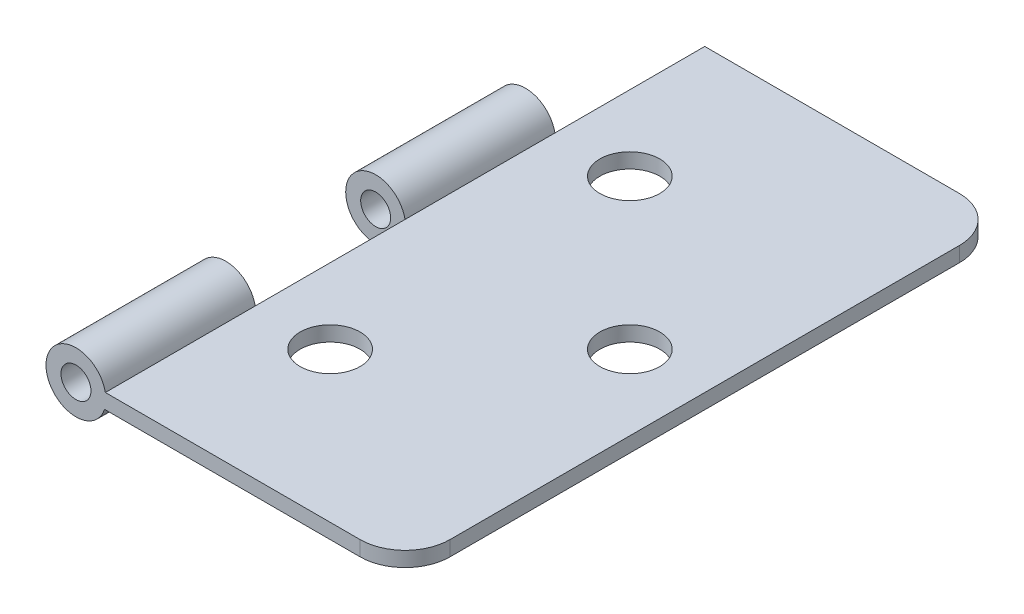
ISO-10303-21;
HEADER;
FILE_DESCRIPTION(('STEP AP214'),'2;1');
FILE_NAME('part.step','',(''),(''),'','','');
FILE_SCHEMA(('AUTOMOTIVE_DESIGN { 1 0 10303 214 1 1 1 1 }'));
ENDSEC;
DATA;
#1=APPLICATION_CONTEXT('core data for automotive mechanical design processes');
#2=APPLICATION_PROTOCOL_DEFINITION('international standard','automotive_design',2000,#1);
#3=PRODUCT_CONTEXT('',#1,'mechanical');
#4=PRODUCT('Part','Part','',(#3));
#5=PRODUCT_RELATED_PRODUCT_CATEGORY('part','',(#4));
#6=PRODUCT_DEFINITION_FORMATION('','',#4);
#7=PRODUCT_DEFINITION_CONTEXT('part definition',#1,'design');
#8=PRODUCT_DEFINITION('design','',#6,#7);
#9=PRODUCT_DEFINITION_SHAPE('','',#8);
#10=(LENGTH_UNIT() NAMED_UNIT(*) SI_UNIT(.MILLI.,.METRE.));
#11=(NAMED_UNIT(*) PLANE_ANGLE_UNIT() SI_UNIT($,.RADIAN.));
#12=(NAMED_UNIT(*) SI_UNIT($,.STERADIAN.) SOLID_ANGLE_UNIT());
#13=UNCERTAINTY_MEASURE_WITH_UNIT(LENGTH_MEASURE(1.E-05),#10,'distance_accuracy_value','');
#14=(GEOMETRIC_REPRESENTATION_CONTEXT(3) GLOBAL_UNCERTAINTY_ASSIGNED_CONTEXT((#13)) GLOBAL_UNIT_ASSIGNED_CONTEXT((#10,
#11,#12)) REPRESENTATION_CONTEXT('',''));
#15=CARTESIAN_POINT('',(0.,0.,0.));
#16=DIRECTION('',(0.,0.,1.));
#17=DIRECTION('',(1.,0.,0.));
#18=AXIS2_PLACEMENT_3D('',#15,#16,#17);
#19=CARTESIAN_POINT('',(-7.85329821480531,0.608036601797693,-40.));
#20=DIRECTION('',(0.,0.,1.));
#21=DIRECTION('',(1.,0.,0.));
#22=AXIS2_PLACEMENT_3D('',#19,#20,#21);
#23=CYLINDRICAL_SURFACE('',#22,2.);
#24=CARTESIAN_POINT('',(-7.85329821480531,0.608036601797693,-30.));
#25=DIRECTION('',(0.,0.,1.));
#26=DIRECTION('',(1.,0.,0.));
#27=AXIS2_PLACEMENT_3D('',#24,#25,#26);
#28=CIRCLE('',#27,2.);
#29=CARTESIAN_POINT('',(-5.94796583149936,0.,-30.));
#30=VERTEX_POINT('',#29);
#31=CARTESIAN_POINT('',(-5.89208310817633,1.,-30.));
#32=VERTEX_POINT('',#31);
#33=EDGE_CURVE('E149',#30,#32,#28,.T.);
#34=ORIENTED_EDGE('',*,*,#33,.T.);
#35=DIRECTION('',(0.,0.,1.));
#36=VECTOR('',#35,1.);
#37=CARTESIAN_POINT('',(-5.89208310817633,1.,-40.));
#38=LINE('',#37,#36);
#39=CARTESIAN_POINT('',(-5.89208310817633,1.,-40.));
#40=VERTEX_POINT('',#39);
#41=EDGE_CURVE('E196',#40,#32,#38,.T.);
#42=ORIENTED_EDGE('',*,*,#41,.F.);
#43=CARTESIAN_POINT('',(-7.85329821480531,0.608036601797693,-40.));
#44=DIRECTION('',(0.,0.,1.));
#45=DIRECTION('',(1.,0.,0.));
#46=AXIS2_PLACEMENT_3D('',#43,#44,#45);
#47=CIRCLE('',#46,2.);
#48=CARTESIAN_POINT('',(-5.94796583149936,0.,-40.));
#49=VERTEX_POINT('',#48);
#50=EDGE_CURVE('E181',#49,#40,#47,.T.);
#51=ORIENTED_EDGE('',*,*,#50,.F.);
#52=DIRECTION('',(0.,0.,1.));
#53=VECTOR('',#52,1.);
#54=CARTESIAN_POINT('',(-5.94796583149936,0.,-40.));
#55=LINE('',#54,#53);
#56=EDGE_CURVE('E124',#49,#30,#55,.T.);
#57=ORIENTED_EDGE('',*,*,#56,.T.);
#58=EDGE_LOOP('',(#34,#42,#51,#57));
#59=FACE_BOUND('',#58,.T.);
#60=ADVANCED_FACE('F41',(#59),#23,.F.);
#61=CARTESIAN_POINT('',(-5.89208310817633,1.,-20.));
#62=VERTEX_POINT('',#61);
#63=CARTESIAN_POINT('',(-5.89208310817633,1.,-10.));
#64=VERTEX_POINT('',#63);
#65=EDGE_CURVE('E128',#62,#64,#38,.T.);
#66=ORIENTED_EDGE('',*,*,#65,.F.);
#67=CARTESIAN_POINT('',(-7.85329821480531,0.608036601797693,-20.));
#68=DIRECTION('',(0.,0.,1.));
#69=DIRECTION('',(1.,0.,0.));
#70=AXIS2_PLACEMENT_3D('',#67,#68,#69);
#71=CIRCLE('',#70,2.);
#72=CARTESIAN_POINT('',(-5.94796583149936,0.,-20.));
#73=VERTEX_POINT('',#72);
#74=EDGE_CURVE('E126',#73,#62,#71,.T.);
#75=ORIENTED_EDGE('',*,*,#74,.F.);
#76=CARTESIAN_POINT('',(-5.94796583149936,0.,-10.));
#77=VERTEX_POINT('',#76);
#78=EDGE_CURVE('E109',#73,#77,#55,.T.);
#79=ORIENTED_EDGE('',*,*,#78,.T.);
#80=CARTESIAN_POINT('',(-7.85329821480531,0.608036601797693,-10.));
#81=DIRECTION('',(0.,0.,1.));
#82=DIRECTION('',(1.,0.,0.));
#83=AXIS2_PLACEMENT_3D('',#80,#81,#82);
#84=CIRCLE('',#83,2.);
#85=EDGE_CURVE('E162',#77,#64,#84,.T.);
#86=ORIENTED_EDGE('',*,*,#85,.T.);
#87=EDGE_LOOP('',(#66,#75,#79,#86));
#88=FACE_BOUND('',#87,.T.);
#89=ADVANCED_FACE('F127',(#88),#23,.F.);
#90=CARTESIAN_POINT('',(0.,1.,-40.));
#91=DIRECTION('',(0.,-1.,0.));
#92=DIRECTION('',(0.,0.,-1.));
#93=AXIS2_PLACEMENT_3D('',#90,#91,#92);
#94=PLANE('',#93);
#95=CARTESIAN_POINT('',(-0.892083108176333,1.,-30.));
#96=DIRECTION('',(0.,1.,0.));
#97=DIRECTION('',(0.,0.,1.));
#98=AXIS2_PLACEMENT_3D('',#95,#96,#97);
#99=CIRCLE('',#98,2.);
#100=CARTESIAN_POINT('',(-0.892083108176333,1.,-28.));
#101=VERTEX_POINT('',#100);
#102=EDGE_CURVE('E214',#101,#101,#99,.T.);
#103=ORIENTED_EDGE('',*,*,#102,.F.);
#104=EDGE_LOOP('',(#103));
#105=FACE_BOUND('',#104,.T.);
#106=CARTESIAN_POINT('',(-0.892083108176333,1.,-10.));
#107=DIRECTION('',(0.,1.,0.));
#108=DIRECTION('',(0.,0.,1.));
#109=AXIS2_PLACEMENT_3D('',#106,#107,#108);
#110=CIRCLE('',#109,2.);
#111=CARTESIAN_POINT('',(-0.892083108176333,1.,-8.));
#112=VERTEX_POINT('',#111);
#113=EDGE_CURVE('E252',#112,#112,#110,.T.);
#114=ORIENTED_EDGE('',*,*,#113,.F.);
#115=EDGE_LOOP('',(#114));
#116=FACE_BOUND('',#115,.T.);
#117=CARTESIAN_POINT('',(9.10791689182367,1.,-20.));
#118=DIRECTION('',(0.,1.,0.));
#119=DIRECTION('',(0.,0.,1.));
#120=AXIS2_PLACEMENT_3D('',#117,#118,#119);
#121=CIRCLE('',#120,2.);
#122=CARTESIAN_POINT('',(9.10791689182367,1.,-18.));
#123=VERTEX_POINT('',#122);
#124=EDGE_CURVE('E248',#123,#123,#121,.T.);
#125=ORIENTED_EDGE('',*,*,#124,.F.);
#126=EDGE_LOOP('',(#125));
#127=FACE_BOUND('',#126,.T.);
#128=DIRECTION('',(1.,0.,0.));
#129=VECTOR('',#128,1.);
#130=CARTESIAN_POINT('',(0.,1.,0.));
#131=LINE('',#130,#129);
#132=CARTESIAN_POINT('',(-5.89208310817633,1.,0.));
#133=VERTEX_POINT('',#132);
#134=CARTESIAN_POINT('',(11.1079168918237,1.,0.));
#135=VERTEX_POINT('',#134);
#136=EDGE_CURVE('E186',#133,#135,#131,.T.);
#137=ORIENTED_EDGE('',*,*,#136,.T.);
#138=CARTESIAN_POINT('',(11.1079168918237,1.,-3.));
#139=DIRECTION('',(0.,-1.,0.));
#140=DIRECTION('',(0.,0.,-1.));
#141=AXIS2_PLACEMENT_3D('',#138,#139,#140);
#142=CIRCLE('',#141,3.);
#143=CARTESIAN_POINT('',(14.1079168918237,1.,-3.));
#144=VERTEX_POINT('',#143);
#145=EDGE_CURVE('E11',#135,#144,#142,.F.);
#146=ORIENTED_EDGE('',*,*,#145,.T.);
#147=DIRECTION('',(0.,0.,1.));
#148=VECTOR('',#147,1.);
#149=CARTESIAN_POINT('',(14.1079168918237,1.,-40.));
#150=LINE('',#149,#148);
#151=CARTESIAN_POINT('',(14.1079168918237,1.,-37.));
#152=VERTEX_POINT('',#151);
#153=EDGE_CURVE('E201',#152,#144,#150,.T.);
#154=ORIENTED_EDGE('',*,*,#153,.F.);
#155=CARTESIAN_POINT('',(11.1079168918237,1.,-37.));
#156=DIRECTION('',(0.,-1.,0.));
#157=DIRECTION('',(0.,0.,-1.));
#158=AXIS2_PLACEMENT_3D('',#155,#156,#157);
#159=CIRCLE('',#158,3.);
#160=CARTESIAN_POINT('',(11.1079168918237,1.,-40.));
#161=VERTEX_POINT('',#160);
#162=EDGE_CURVE('E231',#152,#161,#159,.F.);
#163=ORIENTED_EDGE('',*,*,#162,.T.);
#164=DIRECTION('',(1.,0.,0.));
#165=VECTOR('',#164,1.);
#166=CARTESIAN_POINT('',(0.,1.,-40.));
#167=LINE('',#166,#165);
#168=EDGE_CURVE('E122',#40,#161,#167,.T.);
#169=ORIENTED_EDGE('',*,*,#168,.F.);
#170=ORIENTED_EDGE('',*,*,#41,.T.);
#171=DIRECTION('',(0.,0.,1.));
#172=VECTOR('',#171,1.);
#173=CARTESIAN_POINT('',(-5.89208310817633,1.,-30.));
#174=LINE('',#173,#172);
#175=EDGE_CURVE('E154',#32,#62,#174,.T.);
#176=ORIENTED_EDGE('',*,*,#175,.T.);
#177=ORIENTED_EDGE('',*,*,#65,.T.);
#178=DIRECTION('',(0.,0.,1.));
#179=VECTOR('',#178,1.);
#180=CARTESIAN_POINT('',(-5.89208310817633,1.,-10.));
#181=LINE('',#180,#179);
#182=EDGE_CURVE('E176',#64,#133,#181,.T.);
#183=ORIENTED_EDGE('',*,*,#182,.T.);
#184=EDGE_LOOP('',(#137,#146,#154,#163,#169,#170,#176,#177,#183));
#185=FACE_BOUND('',#184,.T.);
#186=ADVANCED_FACE('F263',(#105,#116,#127,#185),#94,.F.);
#187=CARTESIAN_POINT('',(14.1079168918237,0.,-40.));
#188=DIRECTION('',(-1.,0.,0.));
#189=DIRECTION('',(0.,0.,1.));
#190=AXIS2_PLACEMENT_3D('',#187,#188,#189);
#191=PLANE('',#190);
#192=ORIENTED_EDGE('',*,*,#153,.T.);
#193=DIRECTION('',(0.,-1.,0.));
#194=VECTOR('',#193,1.);
#195=CARTESIAN_POINT('',(14.1079168918237,0.,-3.));
#196=LINE('',#195,#194);
#197=CARTESIAN_POINT('',(14.1079168918237,0.,-3.));
#198=VERTEX_POINT('',#197);
#199=EDGE_CURVE('E234',#144,#198,#196,.T.);
#200=ORIENTED_EDGE('',*,*,#199,.T.);
#201=DIRECTION('',(0.,0.,1.));
#202=VECTOR('',#201,1.);
#203=CARTESIAN_POINT('',(14.1079168918237,0.,-40.));
#204=LINE('',#203,#202);
#205=CARTESIAN_POINT('',(14.1079168918237,0.,-37.));
#206=VERTEX_POINT('',#205);
#207=EDGE_CURVE('E205',#206,#198,#204,.T.);
#208=ORIENTED_EDGE('',*,*,#207,.F.);
#209=DIRECTION('',(0.,-1.,0.));
#210=VECTOR('',#209,1.);
#211=CARTESIAN_POINT('',(14.1079168918237,0.,-37.));
#212=LINE('',#211,#210);
#213=EDGE_CURVE('E228',#206,#152,#212,.F.);
#214=ORIENTED_EDGE('',*,*,#213,.T.);
#215=EDGE_LOOP('',(#192,#200,#208,#214));
#216=FACE_BOUND('',#215,.T.);
#217=ADVANCED_FACE('F266',(#216),#191,.F.);
#218=CARTESIAN_POINT('',(0.,0.,-40.));
#219=DIRECTION('',(0.,1.,0.));
#220=DIRECTION('',(-1.,0.,0.));
#221=AXIS2_PLACEMENT_3D('',#218,#219,#220);
#222=PLANE('',#221);
#223=CARTESIAN_POINT('',(-0.892083108176333,0.,-30.));
#224=DIRECTION('',(0.,1.,0.));
#225=DIRECTION('',(-1.,0.,0.));
#226=AXIS2_PLACEMENT_3D('',#223,#224,#225);
#227=CIRCLE('',#226,2.);
#228=CARTESIAN_POINT('',(-2.89208310817633,0.,-30.));
#229=VERTEX_POINT('',#228);
#230=EDGE_CURVE('E218',#229,#229,#227,.T.);
#231=ORIENTED_EDGE('',*,*,#230,.T.);
#232=EDGE_LOOP('',(#231));
#233=FACE_BOUND('',#232,.T.);
#234=CARTESIAN_POINT('',(-0.892083108176333,0.,-10.));
#235=DIRECTION('',(0.,1.,0.));
#236=DIRECTION('',(-1.,0.,0.));
#237=AXIS2_PLACEMENT_3D('',#234,#235,#236);
#238=CIRCLE('',#237,2.);
#239=CARTESIAN_POINT('',(-2.89208310817633,0.,-10.));
#240=VERTEX_POINT('',#239);
#241=EDGE_CURVE('E213',#240,#240,#238,.T.);
#242=ORIENTED_EDGE('',*,*,#241,.T.);
#243=EDGE_LOOP('',(#242));
#244=FACE_BOUND('',#243,.T.);
#245=CARTESIAN_POINT('',(9.10791689182367,0.,-20.));
#246=DIRECTION('',(0.,1.,0.));
#247=DIRECTION('',(-1.,0.,0.));
#248=AXIS2_PLACEMENT_3D('',#245,#246,#247);
#249=CIRCLE('',#248,2.);
#250=CARTESIAN_POINT('',(7.10791689182367,0.,-20.));
#251=VERTEX_POINT('',#250);
#252=EDGE_CURVE('E209',#251,#251,#249,.T.);
#253=ORIENTED_EDGE('',*,*,#252,.T.);
#254=EDGE_LOOP('',(#253));
#255=FACE_BOUND('',#254,.T.);
#256=ORIENTED_EDGE('',*,*,#207,.T.);
#257=CARTESIAN_POINT('',(11.1079168918237,0.,-3.));
#258=DIRECTION('',(0.,1.,0.));
#259=DIRECTION('',(-1.,0.,0.));
#260=AXIS2_PLACEMENT_3D('',#257,#258,#259);
#261=CIRCLE('',#260,3.);
#262=CARTESIAN_POINT('',(11.1079168918237,0.,0.));
#263=VERTEX_POINT('',#262);
#264=EDGE_CURVE('E64',#198,#263,#261,.F.);
#265=ORIENTED_EDGE('',*,*,#264,.T.);
#266=DIRECTION('',(-1.,0.,0.));
#267=VECTOR('',#266,1.);
#268=CARTESIAN_POINT('',(0.,0.,0.));
#269=LINE('',#268,#267);
#270=CARTESIAN_POINT('',(-5.94796583149936,0.,0.));
#271=VERTEX_POINT('',#270);
#272=EDGE_CURVE('E180',#263,#271,#269,.T.);
#273=ORIENTED_EDGE('',*,*,#272,.T.);
#274=DIRECTION('',(0.,0.,1.));
#275=VECTOR('',#274,1.);
#276=CARTESIAN_POINT('',(-5.94796583149936,0.,-10.));
#277=LINE('',#276,#275);
#278=EDGE_CURVE('E117',#271,#77,#277,.F.);
#279=ORIENTED_EDGE('',*,*,#278,.T.);
#280=ORIENTED_EDGE('',*,*,#78,.F.);
#281=EDGE_CURVE('E114',#30,#73,#55,.T.);
#282=ORIENTED_EDGE('',*,*,#281,.F.);
#283=ORIENTED_EDGE('',*,*,#56,.F.);
#284=DIRECTION('',(-1.,0.,0.));
#285=VECTOR('',#284,1.);
#286=CARTESIAN_POINT('',(0.,0.,-40.));
#287=LINE('',#286,#285);
#288=CARTESIAN_POINT('',(11.1079168918237,0.,-40.));
#289=VERTEX_POINT('',#288);
#290=EDGE_CURVE('E185',#289,#49,#287,.T.);
#291=ORIENTED_EDGE('',*,*,#290,.F.);
#292=CARTESIAN_POINT('',(11.1079168918237,0.,-37.));
#293=DIRECTION('',(0.,1.,0.));
#294=DIRECTION('',(-1.,0.,0.));
#295=AXIS2_PLACEMENT_3D('',#292,#293,#294);
#296=CIRCLE('',#295,3.);
#297=EDGE_CURVE('E225',#289,#206,#296,.F.);
#298=ORIENTED_EDGE('',*,*,#297,.T.);
#299=EDGE_LOOP('',(#256,#265,#273,#279,#280,#282,#283,#291,#298));
#300=FACE_BOUND('',#299,.T.);
#301=ADVANCED_FACE('F111',(#233,#244,#255,#300),#222,.F.);
#302=CARTESIAN_POINT('',(0.,0.,-40.));
#303=DIRECTION('',(0.,0.,1.));
#304=DIRECTION('',(1.,0.,0.));
#305=AXIS2_PLACEMENT_3D('',#302,#303,#304);
#306=PLANE('',#305);
#307=ORIENTED_EDGE('',*,*,#168,.T.);
#308=DIRECTION('',(0.,-1.,0.));
#309=VECTOR('',#308,1.);
#310=CARTESIAN_POINT('',(11.1079168918237,0.,-40.));
#311=LINE('',#310,#309);
#312=EDGE_CURVE('E200',#161,#289,#311,.T.);
#313=ORIENTED_EDGE('',*,*,#312,.T.);
#314=ORIENTED_EDGE('',*,*,#290,.T.);
#315=ORIENTED_EDGE('',*,*,#50,.T.);
#316=EDGE_LOOP('',(#307,#313,#314,#315));
#317=FACE_BOUND('',#316,.T.);
#318=ADVANCED_FACE('F287',(#317),#306,.F.);
#319=CARTESIAN_POINT('',(0.,0.,0.));
#320=DIRECTION('',(0.,0.,1.));
#321=DIRECTION('',(1.,0.,0.));
#322=AXIS2_PLACEMENT_3D('',#319,#320,#321);
#323=PLANE('',#322);
#324=ORIENTED_EDGE('',*,*,#272,.F.);
#325=DIRECTION('',(0.,-1.,0.));
#326=VECTOR('',#325,1.);
#327=CARTESIAN_POINT('',(11.1079168918237,1.,0.));
#328=LINE('',#327,#326);
#329=EDGE_CURVE('E50',#263,#135,#328,.F.);
#330=ORIENTED_EDGE('',*,*,#329,.T.);
#331=ORIENTED_EDGE('',*,*,#136,.F.);
#332=CARTESIAN_POINT('',(-7.85329821480531,0.608036601797693,0.));
#333=DIRECTION('',(0.,0.,1.));
#334=DIRECTION('',(1.,0.,0.));
#335=AXIS2_PLACEMENT_3D('',#332,#333,#334);
#336=CIRCLE('',#335,2.);
#337=EDGE_CURVE('E163',#133,#271,#336,.T.);
#338=ORIENTED_EDGE('',*,*,#337,.T.);
#339=EDGE_LOOP('',(#324,#330,#331,#338));
#340=FACE_BOUND('',#339,.T.);
#341=CARTESIAN_POINT('',(-7.85329821480531,0.608036601797693,0.));
#342=DIRECTION('',(0.,0.,1.));
#343=DIRECTION('',(1.,0.,0.));
#344=AXIS2_PLACEMENT_3D('',#341,#342,#343);
#345=CIRCLE('',#344,1.);
#346=CARTESIAN_POINT('',(-6.85329821480531,0.608036601797693,0.));
#347=VERTEX_POINT('',#346);
#348=EDGE_CURVE('E157',#347,#347,#345,.T.);
#349=ORIENTED_EDGE('',*,*,#348,.F.);
#350=EDGE_LOOP('',(#349));
#351=FACE_BOUND('',#350,.T.);
#352=ADVANCED_FACE('F337',(#340,#351),#323,.T.);
#353=CARTESIAN_POINT('',(-7.85329821480531,0.608036601797693,-10.));
#354=DIRECTION('',(0.,0.,1.));
#355=DIRECTION('',(1.,0.,0.));
#356=AXIS2_PLACEMENT_3D('',#353,#354,#355);
#357=CYLINDRICAL_SURFACE('',#356,2.);
#358=ORIENTED_EDGE('',*,*,#182,.F.);
#359=EDGE_CURVE('E164',#64,#77,#84,.T.);
#360=ORIENTED_EDGE('',*,*,#359,.T.);
#361=ORIENTED_EDGE('',*,*,#278,.F.);
#362=ORIENTED_EDGE('',*,*,#337,.F.);
#363=EDGE_LOOP('',(#358,#360,#361,#362));
#364=FACE_BOUND('',#363,.T.);
#365=ADVANCED_FACE('F347',(#364),#357,.T.);
#366=CARTESIAN_POINT('',(-7.85329821480531,0.608036601797693,-10.));
#367=DIRECTION('',(0.,0.,1.));
#368=DIRECTION('',(1.,0.,0.));
#369=AXIS2_PLACEMENT_3D('',#366,#367,#368);
#370=CYLINDRICAL_SURFACE('',#369,1.);
#371=CARTESIAN_POINT('',(-7.85329821480531,0.608036601797693,-10.));
#372=DIRECTION('',(0.,0.,1.));
#373=DIRECTION('',(1.,0.,0.));
#374=AXIS2_PLACEMENT_3D('',#371,#372,#373);
#375=CIRCLE('',#374,1.);
#376=CARTESIAN_POINT('',(-6.85329821480531,0.608036601797693,-10.));
#377=VERTEX_POINT('',#376);
#378=EDGE_CURVE('E158',#377,#377,#375,.T.);
#379=ORIENTED_EDGE('',*,*,#378,.F.);
#380=EDGE_LOOP('',(#379));
#381=FACE_BOUND('',#380,.T.);
#382=ORIENTED_EDGE('',*,*,#348,.T.);
#383=EDGE_LOOP('',(#382));
#384=FACE_BOUND('',#383,.T.);
#385=ADVANCED_FACE('F349',(#381,#384),#370,.F.);
#386=CARTESIAN_POINT('',(0.,0.,-10.));
#387=DIRECTION('',(0.,0.,1.));
#388=DIRECTION('',(1.,0.,0.));
#389=AXIS2_PLACEMENT_3D('',#386,#387,#388);
#390=PLANE('',#389);
#391=ORIENTED_EDGE('',*,*,#378,.T.);
#392=EDGE_LOOP('',(#391));
#393=FACE_BOUND('',#392,.T.);
#394=ORIENTED_EDGE('',*,*,#359,.F.);
#395=ORIENTED_EDGE('',*,*,#85,.F.);
#396=EDGE_LOOP('',(#394,#395));
#397=FACE_BOUND('',#396,.T.);
#398=ADVANCED_FACE('F352',(#393,#397),#390,.F.);
#399=CARTESIAN_POINT('',(-7.85329821480531,0.608036601797693,-30.));
#400=DIRECTION('',(0.,0.,1.));
#401=DIRECTION('',(1.,0.,0.));
#402=AXIS2_PLACEMENT_3D('',#399,#400,#401);
#403=CYLINDRICAL_SURFACE('',#402,2.);
#404=ORIENTED_EDGE('',*,*,#175,.F.);
#405=EDGE_CURVE('E142',#32,#30,#28,.T.);
#406=ORIENTED_EDGE('',*,*,#405,.T.);
#407=ORIENTED_EDGE('',*,*,#281,.T.);
#408=EDGE_CURVE('E134',#62,#73,#71,.T.);
#409=ORIENTED_EDGE('',*,*,#408,.F.);
#410=EDGE_LOOP('',(#404,#406,#407,#409));
#411=FACE_BOUND('',#410,.T.);
#412=ADVANCED_FACE('F140',(#411),#403,.T.);
#413=CARTESIAN_POINT('',(-7.85329821480531,0.608036601797693,-30.));
#414=DIRECTION('',(0.,0.,1.));
#415=DIRECTION('',(1.,0.,0.));
#416=AXIS2_PLACEMENT_3D('',#413,#414,#415);
#417=CYLINDRICAL_SURFACE('',#416,1.);
#418=CARTESIAN_POINT('',(-7.85329821480531,0.608036601797693,-30.));
#419=DIRECTION('',(0.,0.,1.));
#420=DIRECTION('',(1.,0.,0.));
#421=AXIS2_PLACEMENT_3D('',#418,#419,#420);
#422=CIRCLE('',#421,1.);
#423=CARTESIAN_POINT('',(-6.85329821480531,0.608036601797693,-30.));
#424=VERTEX_POINT('',#423);
#425=EDGE_CURVE('E146',#424,#424,#422,.T.);
#426=ORIENTED_EDGE('',*,*,#425,.F.);
#427=EDGE_LOOP('',(#426));
#428=FACE_BOUND('',#427,.T.);
#429=CARTESIAN_POINT('',(-7.85329821480531,0.608036601797693,-20.));
#430=DIRECTION('',(0.,0.,1.));
#431=DIRECTION('',(1.,0.,0.));
#432=AXIS2_PLACEMENT_3D('',#429,#430,#431);
#433=CIRCLE('',#432,1.);
#434=CARTESIAN_POINT('',(-6.85329821480531,0.608036601797693,-20.));
#435=VERTEX_POINT('',#434);
#436=EDGE_CURVE('E135',#435,#435,#433,.T.);
#437=ORIENTED_EDGE('',*,*,#436,.T.);
#438=EDGE_LOOP('',(#437));
#439=FACE_BOUND('',#438,.T.);
#440=ADVANCED_FACE('F292',(#428,#439),#417,.F.);
#441=CARTESIAN_POINT('',(0.,0.,-30.));
#442=DIRECTION('',(0.,0.,1.));
#443=DIRECTION('',(1.,0.,0.));
#444=AXIS2_PLACEMENT_3D('',#441,#442,#443);
#445=PLANE('',#444);
#446=ORIENTED_EDGE('',*,*,#425,.T.);
#447=EDGE_LOOP('',(#446));
#448=FACE_BOUND('',#447,.T.);
#449=ORIENTED_EDGE('',*,*,#405,.F.);
#450=ORIENTED_EDGE('',*,*,#33,.F.);
#451=EDGE_LOOP('',(#449,#450));
#452=FACE_BOUND('',#451,.T.);
#453=ADVANCED_FACE('F290',(#448,#452),#445,.F.);
#454=CARTESIAN_POINT('',(0.,0.,-20.));
#455=DIRECTION('',(0.,0.,1.));
#456=DIRECTION('',(1.,0.,0.));
#457=AXIS2_PLACEMENT_3D('',#454,#455,#456);
#458=PLANE('',#457);
#459=ORIENTED_EDGE('',*,*,#436,.F.);
#460=EDGE_LOOP('',(#459));
#461=FACE_BOUND('',#460,.T.);
#462=ORIENTED_EDGE('',*,*,#408,.T.);
#463=ORIENTED_EDGE('',*,*,#74,.T.);
#464=EDGE_LOOP('',(#462,#463));
#465=FACE_BOUND('',#464,.T.);
#466=ADVANCED_FACE('F144',(#461,#465),#458,.T.);
#467=CARTESIAN_POINT('',(9.10791689182367,-9.,-20.));
#468=DIRECTION('',(0.,1.,0.));
#469=DIRECTION('',(0.,0.,1.));
#470=AXIS2_PLACEMENT_3D('',#467,#468,#469);
#471=CYLINDRICAL_SURFACE('',#470,2.);
#472=ORIENTED_EDGE('',*,*,#124,.T.);
#473=EDGE_LOOP('',(#472));
#474=FACE_BOUND('',#473,.T.);
#475=ORIENTED_EDGE('',*,*,#252,.F.);
#476=EDGE_LOOP('',(#475));
#477=FACE_BOUND('',#476,.T.);
#478=ADVANCED_FACE('F299',(#474,#477),#471,.F.);
#479=CARTESIAN_POINT('',(-0.892083108176333,-9.,-10.));
#480=DIRECTION('',(0.,1.,0.));
#481=DIRECTION('',(0.,0.,1.));
#482=AXIS2_PLACEMENT_3D('',#479,#480,#481);
#483=CYLINDRICAL_SURFACE('',#482,2.);
#484=ORIENTED_EDGE('',*,*,#113,.T.);
#485=EDGE_LOOP('',(#484));
#486=FACE_BOUND('',#485,.T.);
#487=ORIENTED_EDGE('',*,*,#241,.F.);
#488=EDGE_LOOP('',(#487));
#489=FACE_BOUND('',#488,.T.);
#490=ADVANCED_FACE('F317',(#486,#489),#483,.F.);
#491=CARTESIAN_POINT('',(-0.892083108176333,-9.,-30.));
#492=DIRECTION('',(0.,1.,0.));
#493=DIRECTION('',(0.,0.,1.));
#494=AXIS2_PLACEMENT_3D('',#491,#492,#493);
#495=CYLINDRICAL_SURFACE('',#494,2.);
#496=ORIENTED_EDGE('',*,*,#102,.T.);
#497=EDGE_LOOP('',(#496));
#498=FACE_BOUND('',#497,.T.);
#499=ORIENTED_EDGE('',*,*,#230,.F.);
#500=EDGE_LOOP('',(#499));
#501=FACE_BOUND('',#500,.T.);
#502=ADVANCED_FACE('F260',(#498,#501),#495,.F.);
#503=CARTESIAN_POINT('',(11.1079168918237,0.,-37.));
#504=DIRECTION('',(0.,-1.,0.));
#505=DIRECTION('',(0.,0.,-1.));
#506=AXIS2_PLACEMENT_3D('',#503,#504,#505);
#507=CYLINDRICAL_SURFACE('',#506,3.);
#508=ORIENTED_EDGE('',*,*,#162,.F.);
#509=ORIENTED_EDGE('',*,*,#213,.F.);
#510=ORIENTED_EDGE('',*,*,#297,.F.);
#511=ORIENTED_EDGE('',*,*,#312,.F.);
#512=EDGE_LOOP('',(#508,#509,#510,#511));
#513=FACE_BOUND('',#512,.T.);
#514=ADVANCED_FACE('F285',(#513),#507,.T.);
#515=CARTESIAN_POINT('',(11.1079168918237,0.,-3.));
#516=DIRECTION('',(0.,1.,0.));
#517=DIRECTION('',(0.,0.,1.));
#518=AXIS2_PLACEMENT_3D('',#515,#516,#517);
#519=CYLINDRICAL_SURFACE('',#518,3.);
#520=ORIENTED_EDGE('',*,*,#145,.F.);
#521=ORIENTED_EDGE('',*,*,#329,.F.);
#522=ORIENTED_EDGE('',*,*,#264,.F.);
#523=ORIENTED_EDGE('',*,*,#199,.F.);
#524=EDGE_LOOP('',(#520,#521,#522,#523));
#525=FACE_BOUND('',#524,.T.);
#526=ADVANCED_FACE('F43',(#525),#519,.T.);
#527=CLOSED_SHELL('',(#60,#89,#186,#217,#301,#318,#352,#365,#385,#398,#412,#440,#453,#466,#478,
#490,#502,#514,#526));
#528=MANIFOLD_SOLID_BREP('B2',#527);
#529=ADVANCED_BREP_SHAPE_REPRESENTATION('',(#18,#528),#14);
#530=SHAPE_DEFINITION_REPRESENTATION(#9,#529);
ENDSEC;
END-ISO-10303-21;
